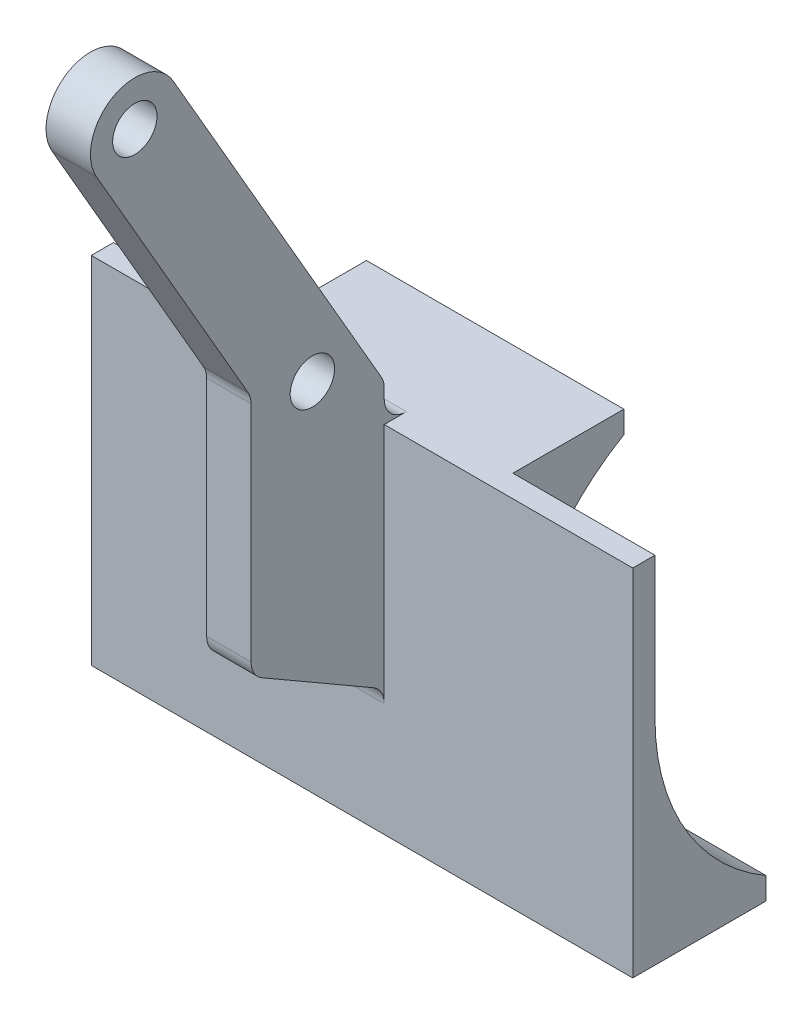
ISO-10303-21;
HEADER;
FILE_DESCRIPTION(('STEP AP214'),'2;1');
FILE_NAME('part.step','',(''),(''),'','','');
FILE_SCHEMA(('AUTOMOTIVE_DESIGN { 1 0 10303 214 1 1 1 1 }'));
ENDSEC;
DATA;
#1=APPLICATION_CONTEXT('core data for automotive mechanical design processes');
#2=APPLICATION_PROTOCOL_DEFINITION('international standard','automotive_design',2000,#1);
#3=PRODUCT_CONTEXT('',#1,'mechanical');
#4=PRODUCT('Part','Part','',(#3));
#5=PRODUCT_RELATED_PRODUCT_CATEGORY('part','',(#4));
#6=PRODUCT_DEFINITION_FORMATION('','',#4);
#7=PRODUCT_DEFINITION_CONTEXT('part definition',#1,'design');
#8=PRODUCT_DEFINITION('design','',#6,#7);
#9=PRODUCT_DEFINITION_SHAPE('','',#8);
#10=(LENGTH_UNIT() NAMED_UNIT(*) SI_UNIT(.MILLI.,.METRE.));
#11=(NAMED_UNIT(*) PLANE_ANGLE_UNIT() SI_UNIT($,.RADIAN.));
#12=(NAMED_UNIT(*) SI_UNIT($,.STERADIAN.) SOLID_ANGLE_UNIT());
#13=UNCERTAINTY_MEASURE_WITH_UNIT(LENGTH_MEASURE(1.E-05),#10,'distance_accuracy_value','');
#14=(GEOMETRIC_REPRESENTATION_CONTEXT(3) GLOBAL_UNCERTAINTY_ASSIGNED_CONTEXT((#13)) GLOBAL_UNIT_ASSIGNED_CONTEXT((#10,
#11,#12)) REPRESENTATION_CONTEXT('',''));
#15=CARTESIAN_POINT('',(0.,0.,0.));
#16=DIRECTION('',(0.,0.,1.));
#17=DIRECTION('',(1.,0.,0.));
#18=AXIS2_PLACEMENT_3D('',#15,#16,#17);
#19=CARTESIAN_POINT('',(76.2,-10.5426131403119,-69.85));
#20=DIRECTION('',(-1.,0.,0.));
#21=DIRECTION('',(0.,0.,1.));
#22=AXIS2_PLACEMENT_3D('',#19,#20,#21);
#23=CYLINDRICAL_SURFACE('',#22,63.5);
#24=CARTESIAN_POINT('',(-36.83,-10.5426131403119,-69.85));
#25=DIRECTION('',(-1.,0.,0.));
#26=DIRECTION('',(0.,0.,-1.));
#27=AXIS2_PLACEMENT_3D('',#24,#25,#26);
#28=CIRCLE('',#27,63.5);
#29=CARTESIAN_POINT('',(-36.83,-10.5426131403118,-6.35000000000001));
#30=VERTEX_POINT('',#29);
#31=CARTESIAN_POINT('',(-36.83,44.45,-38.1));
#32=VERTEX_POINT('',#31);
#33=EDGE_CURVE('E210',#30,#32,#28,.T.);
#34=ORIENTED_EDGE('',*,*,#33,.T.);
#35=DIRECTION('',(-1.,0.,0.));
#36=VECTOR('',#35,1.);
#37=CARTESIAN_POINT('',(76.2,44.45,-38.1));
#38=LINE('',#37,#36);
#39=CARTESIAN_POINT('',(36.83,44.45,-38.1));
#40=VERTEX_POINT('',#39);
#41=EDGE_CURVE('E234',#40,#32,#38,.T.);
#42=ORIENTED_EDGE('',*,*,#41,.F.);
#43=CARTESIAN_POINT('',(36.83,-10.5426131403119,-69.85));
#44=DIRECTION('',(-1.,0.,0.));
#45=DIRECTION('',(0.,0.,-1.));
#46=AXIS2_PLACEMENT_3D('',#43,#44,#45);
#47=CIRCLE('',#46,63.5);
#48=CARTESIAN_POINT('',(36.83,-10.5426131403118,-6.35000000000001));
#49=VERTEX_POINT('',#48);
#50=EDGE_CURVE('E232',#49,#40,#47,.T.);
#51=ORIENTED_EDGE('',*,*,#50,.F.);
#52=DIRECTION('',(-1.,0.,0.));
#53=VECTOR('',#52,1.);
#54=CARTESIAN_POINT('',(76.2,-10.5426131403118,-6.35000000000001));
#55=LINE('',#54,#53);
#56=EDGE_CURVE('E226',#49,#30,#55,.T.);
#57=ORIENTED_EDGE('',*,*,#56,.T.);
#58=EDGE_LOOP('',(#34,#42,#51,#57));
#59=FACE_BOUND('',#58,.T.);
#60=ADVANCED_FACE('F35',(#59),#23,.F.);
#61=CARTESIAN_POINT('',(76.2,50.8,-38.1));
#62=DIRECTION('',(0.,0.,1.));
#63=DIRECTION('',(1.,0.,0.));
#64=AXIS2_PLACEMENT_3D('',#61,#62,#63);
#65=PLANE('',#64);
#66=DIRECTION('',(0.,1.,0.));
#67=VECTOR('',#66,1.);
#68=CARTESIAN_POINT('',(-36.83,44.45,-38.1));
#69=LINE('',#68,#67);
#70=CARTESIAN_POINT('',(-36.83,50.8,-38.1));
#71=VERTEX_POINT('',#70);
#72=EDGE_CURVE('E216',#32,#71,#69,.T.);
#73=ORIENTED_EDGE('',*,*,#72,.T.);
#74=DIRECTION('',(-1.,0.,0.));
#75=VECTOR('',#74,1.);
#76=CARTESIAN_POINT('',(76.2,50.8,-38.1));
#77=LINE('',#76,#75);
#78=CARTESIAN_POINT('',(36.83,50.8,-38.1));
#79=VERTEX_POINT('',#78);
#80=EDGE_CURVE('E239',#79,#71,#77,.T.);
#81=ORIENTED_EDGE('',*,*,#80,.F.);
#82=DIRECTION('',(0.,1.,0.));
#83=VECTOR('',#82,1.);
#84=CARTESIAN_POINT('',(36.83,44.45,-38.1));
#85=LINE('',#84,#83);
#86=EDGE_CURVE('E424',#40,#79,#85,.T.);
#87=ORIENTED_EDGE('',*,*,#86,.F.);
#88=ORIENTED_EDGE('',*,*,#41,.T.);
#89=EDGE_LOOP('',(#73,#81,#87,#88));
#90=FACE_BOUND('',#89,.T.);
#91=ADVANCED_FACE('F423',(#90),#65,.F.);
#92=CARTESIAN_POINT('',(76.2,50.8,0.));
#93=DIRECTION('',(0.,-1.,0.));
#94=DIRECTION('',(0.,0.,-1.));
#95=AXIS2_PLACEMENT_3D('',#92,#93,#94);
#96=PLANE('',#95);
#97=DIRECTION('',(0.,0.,1.));
#98=VECTOR('',#97,1.);
#99=CARTESIAN_POINT('',(-36.83,50.8,-38.1));
#100=LINE('',#99,#98);
#101=CARTESIAN_POINT('',(-36.83,50.8,-6.35));
#102=VERTEX_POINT('',#101);
#103=EDGE_CURVE('E229',#71,#102,#100,.T.);
#104=ORIENTED_EDGE('',*,*,#103,.T.);
#105=DIRECTION('',(1.,0.,0.));
#106=VECTOR('',#105,1.);
#107=CARTESIAN_POINT('',(-77.47,50.8,-6.34999999999998));
#108=LINE('',#107,#106);
#109=CARTESIAN_POINT('',(-77.47,50.8,-6.34999999999998));
#110=VERTEX_POINT('',#109);
#111=EDGE_CURVE('E228',#110,#102,#108,.T.);
#112=ORIENTED_EDGE('',*,*,#111,.F.);
#113=DIRECTION('',(0.,0.,1.));
#114=VECTOR('',#113,1.);
#115=CARTESIAN_POINT('',(-77.47,50.8,0.));
#116=LINE('',#115,#114);
#117=CARTESIAN_POINT('',(-77.47,50.8,0.));
#118=VERTEX_POINT('',#117);
#119=EDGE_CURVE('E342',#110,#118,#116,.T.);
#120=ORIENTED_EDGE('',*,*,#119,.T.);
#121=DIRECTION('',(-1.,0.,0.));
#122=VECTOR('',#121,1.);
#123=CARTESIAN_POINT('',(76.2,50.8,0.));
#124=LINE('',#123,#122);
#125=CARTESIAN_POINT('',(-6.35,50.8,0.));
#126=VERTEX_POINT('',#125);
#127=EDGE_CURVE('E411',#126,#118,#124,.T.);
#128=ORIENTED_EDGE('',*,*,#127,.F.);
#129=DIRECTION('',(0.,0.,-1.));
#130=VECTOR('',#129,1.);
#131=CARTESIAN_POINT('',(-6.34999999999999,50.8,0.));
#132=LINE('',#131,#130);
#133=CARTESIAN_POINT('',(-6.35,50.8,-6.34999999999998));
#134=VERTEX_POINT('',#133);
#135=EDGE_CURVE('E50',#126,#134,#132,.T.);
#136=ORIENTED_EDGE('',*,*,#135,.T.);
#137=DIRECTION('',(-1.,0.,0.));
#138=VECTOR('',#137,1.);
#139=CARTESIAN_POINT('',(6.35,50.8,-6.34999999999998));
#140=LINE('',#139,#138);
#141=CARTESIAN_POINT('',(6.35,50.8,-6.34999999999998));
#142=VERTEX_POINT('',#141);
#143=EDGE_CURVE('E276',#134,#142,#140,.F.);
#144=ORIENTED_EDGE('',*,*,#143,.T.);
#145=DIRECTION('',(0.,0.,1.));
#146=VECTOR('',#145,1.);
#147=CARTESIAN_POINT('',(6.35,50.8,71.3587873496661));
#148=LINE('',#147,#146);
#149=CARTESIAN_POINT('',(6.35,50.8,0.));
#150=VERTEX_POINT('',#149);
#151=EDGE_CURVE('E274',#142,#150,#148,.T.);
#152=ORIENTED_EDGE('',*,*,#151,.T.);
#153=CARTESIAN_POINT('',(77.47,50.8,0.));
#154=VERTEX_POINT('',#153);
#155=EDGE_CURVE('E412',#154,#150,#124,.T.);
#156=ORIENTED_EDGE('',*,*,#155,.F.);
#157=DIRECTION('',(0.,0.,1.));
#158=VECTOR('',#157,1.);
#159=CARTESIAN_POINT('',(77.47,50.8,0.));
#160=LINE('',#159,#158);
#161=CARTESIAN_POINT('',(77.47,50.8,-6.34999999999998));
#162=VERTEX_POINT('',#161);
#163=EDGE_CURVE('E376',#162,#154,#160,.T.);
#164=ORIENTED_EDGE('',*,*,#163,.F.);
#165=DIRECTION('',(-1.,0.,0.));
#166=VECTOR('',#165,1.);
#167=CARTESIAN_POINT('',(77.47,50.8,-6.34999999999998));
#168=LINE('',#167,#166);
#169=CARTESIAN_POINT('',(36.83,50.8,-6.35));
#170=VERTEX_POINT('',#169);
#171=EDGE_CURVE('E391',#162,#170,#168,.T.);
#172=ORIENTED_EDGE('',*,*,#171,.T.);
#173=DIRECTION('',(0.,0.,1.));
#174=VECTOR('',#173,1.);
#175=CARTESIAN_POINT('',(36.83,50.8,-38.1));
#176=LINE('',#175,#174);
#177=EDGE_CURVE('E420',#79,#170,#176,.T.);
#178=ORIENTED_EDGE('',*,*,#177,.F.);
#179=ORIENTED_EDGE('',*,*,#80,.T.);
#180=EDGE_LOOP('',(#104,#112,#120,#128,#136,#144,#152,#156,#164,#172,#178,#179));
#181=FACE_BOUND('',#180,.T.);
#182=ADVANCED_FACE('F418',(#181),#96,.F.);
#183=CARTESIAN_POINT('',(76.2,50.8,0.));
#184=DIRECTION('',(0.,0.,-1.));
#185=DIRECTION('',(0.,1.,0.));
#186=AXIS2_PLACEMENT_3D('',#183,#184,#185);
#187=PLANE('',#186);
#188=DIRECTION('',(-1.,0.,0.));
#189=VECTOR('',#188,1.);
#190=CARTESIAN_POINT('',(-6.34999999999999,-18.3308710467705,0.));
#191=LINE('',#190,#189);
#192=CARTESIAN_POINT('',(6.35,-18.3308710467705,0.));
#193=VERTEX_POINT('',#192);
#194=CARTESIAN_POINT('',(-6.35,-18.3308710467705,0.));
#195=VERTEX_POINT('',#194);
#196=EDGE_CURVE('E245',#193,#195,#191,.T.);
#197=ORIENTED_EDGE('',*,*,#196,.T.);
#198=DIRECTION('',(0.,1.,0.));
#199=VECTOR('',#198,1.);
#200=CARTESIAN_POINT('',(-6.35,14.6646968374165,0.));
#201=LINE('',#200,#199);
#202=EDGE_CURVE('E456',#195,#126,#201,.T.);
#203=ORIENTED_EDGE('',*,*,#202,.T.);
#204=ORIENTED_EDGE('',*,*,#127,.T.);
#205=DIRECTION('',(0.,-1.,0.));
#206=VECTOR('',#205,1.);
#207=CARTESIAN_POINT('',(-77.47,50.8,0.));
#208=LINE('',#207,#206);
#209=CARTESIAN_POINT('',(-77.47,-50.8,0.));
#210=VERTEX_POINT('',#209);
#211=EDGE_CURVE('E357',#118,#210,#208,.T.);
#212=ORIENTED_EDGE('',*,*,#211,.T.);
#213=DIRECTION('',(-1.,0.,0.));
#214=VECTOR('',#213,1.);
#215=CARTESIAN_POINT('',(76.2,-50.8,0.));
#216=LINE('',#215,#214);
#217=CARTESIAN_POINT('',(77.47,-50.8,0.));
#218=VERTEX_POINT('',#217);
#219=EDGE_CURVE('E237',#218,#210,#216,.T.);
#220=ORIENTED_EDGE('',*,*,#219,.F.);
#221=DIRECTION('',(0.,-1.,0.));
#222=VECTOR('',#221,1.);
#223=CARTESIAN_POINT('',(77.47,50.8,0.));
#224=LINE('',#223,#222);
#225=EDGE_CURVE('E379',#154,#218,#224,.T.);
#226=ORIENTED_EDGE('',*,*,#225,.F.);
#227=ORIENTED_EDGE('',*,*,#155,.T.);
#228=DIRECTION('',(0.,1.,0.));
#229=VECTOR('',#228,1.);
#230=CARTESIAN_POINT('',(6.35,14.6646968374165,0.));
#231=LINE('',#230,#229);
#232=EDGE_CURVE('E446',#193,#150,#231,.T.);
#233=ORIENTED_EDGE('',*,*,#232,.F.);
#234=EDGE_LOOP('',(#197,#203,#204,#212,#220,#226,#227,#233));
#235=FACE_BOUND('',#234,.T.);
#236=ADVANCED_FACE('F483',(#235),#187,.F.);
#237=CARTESIAN_POINT('',(76.2,-50.8,-6.35000000000001));
#238=DIRECTION('',(0.,1.,0.));
#239=DIRECTION('',(0.,0.,1.));
#240=AXIS2_PLACEMENT_3D('',#237,#238,#239);
#241=PLANE('',#240);
#242=ORIENTED_EDGE('',*,*,#219,.T.);
#243=DIRECTION('',(0.,0.,-1.));
#244=VECTOR('',#243,1.);
#245=CARTESIAN_POINT('',(-77.47,-50.8,0.));
#246=LINE('',#245,#244);
#247=CARTESIAN_POINT('',(-77.47,-50.8,-38.1));
#248=VERTEX_POINT('',#247);
#249=EDGE_CURVE('E354',#210,#248,#246,.T.);
#250=ORIENTED_EDGE('',*,*,#249,.T.);
#251=DIRECTION('',(1.,0.,0.));
#252=VECTOR('',#251,1.);
#253=CARTESIAN_POINT('',(-77.47,-50.8,-38.1));
#254=LINE('',#253,#252);
#255=CARTESIAN_POINT('',(-39.37,-50.8,-38.1));
#256=VERTEX_POINT('',#255);
#257=EDGE_CURVE('E360',#248,#256,#254,.T.);
#258=ORIENTED_EDGE('',*,*,#257,.T.);
#259=DIRECTION('',(0.,0.,-1.));
#260=VECTOR('',#259,1.);
#261=CARTESIAN_POINT('',(-39.37,-50.8,0.));
#262=LINE('',#261,#260);
#263=CARTESIAN_POINT('',(-39.37,-50.8,-6.35000000000001));
#264=VERTEX_POINT('',#263);
#265=EDGE_CURVE('E346',#264,#256,#262,.T.);
#266=ORIENTED_EDGE('',*,*,#265,.F.);
#267=DIRECTION('',(-1.,0.,0.));
#268=VECTOR('',#267,1.);
#269=CARTESIAN_POINT('',(76.2,-50.8,-6.35000000000001));
#270=LINE('',#269,#268);
#271=CARTESIAN_POINT('',(39.37,-50.8,-6.35000000000001));
#272=VERTEX_POINT('',#271);
#273=EDGE_CURVE('E233',#272,#264,#270,.T.);
#274=ORIENTED_EDGE('',*,*,#273,.F.);
#275=DIRECTION('',(0.,0.,-1.));
#276=VECTOR('',#275,1.);
#277=CARTESIAN_POINT('',(39.37,-50.8,0.));
#278=LINE('',#277,#276);
#279=CARTESIAN_POINT('',(39.37,-50.8,-38.1));
#280=VERTEX_POINT('',#279);
#281=EDGE_CURVE('E375',#272,#280,#278,.T.);
#282=ORIENTED_EDGE('',*,*,#281,.T.);
#283=DIRECTION('',(-1.,0.,0.));
#284=VECTOR('',#283,1.);
#285=CARTESIAN_POINT('',(77.47,-50.8,-38.1));
#286=LINE('',#285,#284);
#287=CARTESIAN_POINT('',(77.47,-50.8,-38.1));
#288=VERTEX_POINT('',#287);
#289=EDGE_CURVE('E404',#288,#280,#286,.T.);
#290=ORIENTED_EDGE('',*,*,#289,.F.);
#291=DIRECTION('',(0.,0.,-1.));
#292=VECTOR('',#291,1.);
#293=CARTESIAN_POINT('',(77.47,-50.8,0.));
#294=LINE('',#293,#292);
#295=EDGE_CURVE('E383',#218,#288,#294,.T.);
#296=ORIENTED_EDGE('',*,*,#295,.F.);
#297=EDGE_LOOP('',(#242,#250,#258,#266,#274,#282,#290,#296));
#298=FACE_BOUND('',#297,.T.);
#299=ADVANCED_FACE('F516',(#298),#241,.F.);
#300=CARTESIAN_POINT('',(76.2,-10.5426131403119,-6.35000000000001));
#301=DIRECTION('',(0.,0.,1.));
#302=DIRECTION('',(0.,-1.,0.));
#303=AXIS2_PLACEMENT_3D('',#300,#301,#302);
#304=PLANE('',#303);
#305=DIRECTION('',(0.,1.,0.));
#306=VECTOR('',#305,1.);
#307=CARTESIAN_POINT('',(-39.37,-50.8,-6.35000000000001));
#308=LINE('',#307,#306);
#309=CARTESIAN_POINT('',(-39.37,10.5426131403119,-6.35000000000002));
#310=VERTEX_POINT('',#309);
#311=EDGE_CURVE('E407',#264,#310,#308,.T.);
#312=ORIENTED_EDGE('',*,*,#311,.T.);
#313=DIRECTION('',(1.,0.,0.));
#314=VECTOR('',#313,1.);
#315=CARTESIAN_POINT('',(-77.47,10.5426131403119,-6.34999999999999));
#316=LINE('',#315,#314);
#317=CARTESIAN_POINT('',(-77.47,10.5426131403119,-6.34999999999999));
#318=VERTEX_POINT('',#317);
#319=EDGE_CURVE('E371',#318,#310,#316,.T.);
#320=ORIENTED_EDGE('',*,*,#319,.F.);
#321=DIRECTION('',(0.,1.,0.));
#322=VECTOR('',#321,1.);
#323=CARTESIAN_POINT('',(-77.47,50.8,-6.34999999999998));
#324=LINE('',#323,#322);
#325=EDGE_CURVE('E345',#318,#110,#324,.T.);
#326=ORIENTED_EDGE('',*,*,#325,.T.);
#327=ORIENTED_EDGE('',*,*,#111,.T.);
#328=DIRECTION('',(0.,-1.,0.));
#329=VECTOR('',#328,1.);
#330=CARTESIAN_POINT('',(-36.83,50.8,-6.35));
#331=LINE('',#330,#329);
#332=EDGE_CURVE('E213',#102,#30,#331,.T.);
#333=ORIENTED_EDGE('',*,*,#332,.T.);
#334=ORIENTED_EDGE('',*,*,#56,.F.);
#335=DIRECTION('',(0.,-1.,0.));
#336=VECTOR('',#335,1.);
#337=CARTESIAN_POINT('',(36.83,50.8,-6.35));
#338=LINE('',#337,#336);
#339=EDGE_CURVE('E431',#170,#49,#338,.T.);
#340=ORIENTED_EDGE('',*,*,#339,.F.);
#341=ORIENTED_EDGE('',*,*,#171,.F.);
#342=DIRECTION('',(0.,1.,0.));
#343=VECTOR('',#342,1.);
#344=CARTESIAN_POINT('',(77.47,50.8,-6.34999999999998));
#345=LINE('',#344,#343);
#346=CARTESIAN_POINT('',(77.47,10.5426131403119,-6.34999999999999));
#347=VERTEX_POINT('',#346);
#348=EDGE_CURVE('E389',#347,#162,#345,.T.);
#349=ORIENTED_EDGE('',*,*,#348,.F.);
#350=DIRECTION('',(-1.,0.,0.));
#351=VECTOR('',#350,1.);
#352=CARTESIAN_POINT('',(77.47,10.5426131403119,-6.34999999999999));
#353=LINE('',#352,#351);
#354=CARTESIAN_POINT('',(39.37,10.5426131403119,-6.35000000000001));
#355=VERTEX_POINT('',#354);
#356=EDGE_CURVE('E398',#347,#355,#353,.T.);
#357=ORIENTED_EDGE('',*,*,#356,.T.);
#358=DIRECTION('',(0.,1.,0.));
#359=VECTOR('',#358,1.);
#360=CARTESIAN_POINT('',(39.37,-50.8,-6.35000000000001));
#361=LINE('',#360,#359);
#362=EDGE_CURVE('E409',#272,#355,#361,.T.);
#363=ORIENTED_EDGE('',*,*,#362,.F.);
#364=ORIENTED_EDGE('',*,*,#273,.T.);
#365=EDGE_LOOP('',(#312,#320,#326,#327,#333,#334,#340,#341,#349,#357,#363,#364));
#366=FACE_BOUND('',#365,.T.);
#367=ADVANCED_FACE('F224',(#366),#304,.F.);
#368=CARTESIAN_POINT('',(39.37,10.5426131403119,-69.85));
#369=DIRECTION('',(1.,0.,0.));
#370=DIRECTION('',(0.,0.,-1.));
#371=AXIS2_PLACEMENT_3D('',#368,#369,#370);
#372=PLANE('',#371);
#373=ORIENTED_EDGE('',*,*,#281,.F.);
#374=ORIENTED_EDGE('',*,*,#362,.T.);
#375=CARTESIAN_POINT('',(39.37,10.5426131403119,-69.85));
#376=DIRECTION('',(-1.,0.,0.));
#377=DIRECTION('',(0.,0.,-1.));
#378=AXIS2_PLACEMENT_3D('',#375,#376,#377);
#379=CIRCLE('',#378,63.5);
#380=CARTESIAN_POINT('',(39.37,-44.45,-38.1));
#381=VERTEX_POINT('',#380);
#382=EDGE_CURVE('E244',#381,#355,#379,.T.);
#383=ORIENTED_EDGE('',*,*,#382,.F.);
#384=DIRECTION('',(0.,1.,0.));
#385=VECTOR('',#384,1.);
#386=CARTESIAN_POINT('',(39.37,-50.8,-38.1));
#387=LINE('',#386,#385);
#388=EDGE_CURVE('E380',#280,#381,#387,.T.);
#389=ORIENTED_EDGE('',*,*,#388,.F.);
#390=EDGE_LOOP('',(#373,#374,#383,#389));
#391=FACE_BOUND('',#390,.T.);
#392=ADVANCED_FACE('F515',(#391),#372,.F.);
#393=CARTESIAN_POINT('',(77.47,-50.8,-38.1));
#394=DIRECTION('',(0.,0.,1.));
#395=DIRECTION('',(1.,0.,0.));
#396=AXIS2_PLACEMENT_3D('',#393,#394,#395);
#397=PLANE('',#396);
#398=ORIENTED_EDGE('',*,*,#388,.T.);
#399=DIRECTION('',(-1.,0.,0.));
#400=VECTOR('',#399,1.);
#401=CARTESIAN_POINT('',(77.47,-44.45,-38.1));
#402=LINE('',#401,#400);
#403=CARTESIAN_POINT('',(77.47,-44.45,-38.1));
#404=VERTEX_POINT('',#403);
#405=EDGE_CURVE('E401',#404,#381,#402,.T.);
#406=ORIENTED_EDGE('',*,*,#405,.F.);
#407=DIRECTION('',(0.,1.,0.));
#408=VECTOR('',#407,1.);
#409=CARTESIAN_POINT('',(77.47,-50.8,-38.1));
#410=LINE('',#409,#408);
#411=EDGE_CURVE('E385',#288,#404,#410,.T.);
#412=ORIENTED_EDGE('',*,*,#411,.F.);
#413=ORIENTED_EDGE('',*,*,#289,.T.);
#414=EDGE_LOOP('',(#398,#406,#412,#413));
#415=FACE_BOUND('',#414,.T.);
#416=ADVANCED_FACE('F527',(#415),#397,.F.);
#417=CARTESIAN_POINT('',(77.47,10.5426131403119,-69.85));
#418=DIRECTION('',(-1.,0.,0.));
#419=DIRECTION('',(0.,0.,1.));
#420=AXIS2_PLACEMENT_3D('',#417,#418,#419);
#421=CYLINDRICAL_SURFACE('',#420,63.5);
#422=ORIENTED_EDGE('',*,*,#405,.T.);
#423=ORIENTED_EDGE('',*,*,#382,.T.);
#424=ORIENTED_EDGE('',*,*,#356,.F.);
#425=CARTESIAN_POINT('',(77.47,10.5426131403119,-69.85));
#426=DIRECTION('',(-1.,0.,0.));
#427=DIRECTION('',(0.,0.,-1.));
#428=AXIS2_PLACEMENT_3D('',#425,#426,#427);
#429=CIRCLE('',#428,63.5);
#430=EDGE_CURVE('E387',#404,#347,#429,.T.);
#431=ORIENTED_EDGE('',*,*,#430,.F.);
#432=EDGE_LOOP('',(#422,#423,#424,#431));
#433=FACE_BOUND('',#432,.T.);
#434=ADVANCED_FACE('F530',(#433),#421,.F.);
#435=CARTESIAN_POINT('',(77.47,10.5426131403119,-69.85));
#436=DIRECTION('',(1.,0.,0.));
#437=DIRECTION('',(0.,0.,-1.));
#438=AXIS2_PLACEMENT_3D('',#435,#436,#437);
#439=PLANE('',#438);
#440=ORIENTED_EDGE('',*,*,#163,.T.);
#441=ORIENTED_EDGE('',*,*,#225,.T.);
#442=ORIENTED_EDGE('',*,*,#295,.T.);
#443=ORIENTED_EDGE('',*,*,#411,.T.);
#444=ORIENTED_EDGE('',*,*,#430,.T.);
#445=ORIENTED_EDGE('',*,*,#348,.T.);
#446=EDGE_LOOP('',(#440,#441,#442,#443,#444,#445));
#447=FACE_BOUND('',#446,.T.);
#448=ADVANCED_FACE('F534',(#447),#439,.T.);
#449=CARTESIAN_POINT('',(-77.47,10.5426131403119,-69.85));
#450=DIRECTION('',(1.,0.,0.));
#451=DIRECTION('',(0.,0.,-1.));
#452=AXIS2_PLACEMENT_3D('',#449,#450,#451);
#453=CYLINDRICAL_SURFACE('',#452,63.5);
#454=CARTESIAN_POINT('',(-39.37,10.5426131403119,-69.85));
#455=DIRECTION('',(-1.,0.,0.));
#456=DIRECTION('',(0.,0.,-1.));
#457=AXIS2_PLACEMENT_3D('',#454,#455,#456);
#458=CIRCLE('',#457,63.5);
#459=CARTESIAN_POINT('',(-39.37,-44.45,-38.1));
#460=VERTEX_POINT('',#459);
#461=EDGE_CURVE('E249',#460,#310,#458,.T.);
#462=ORIENTED_EDGE('',*,*,#461,.F.);
#463=DIRECTION('',(1.,0.,0.));
#464=VECTOR('',#463,1.);
#465=CARTESIAN_POINT('',(-77.47,-44.45,-38.1));
#466=LINE('',#465,#464);
#467=CARTESIAN_POINT('',(-77.47,-44.45,-38.1));
#468=VERTEX_POINT('',#467);
#469=EDGE_CURVE('E368',#468,#460,#466,.T.);
#470=ORIENTED_EDGE('',*,*,#469,.F.);
#471=CARTESIAN_POINT('',(-77.47,10.5426131403119,-69.85));
#472=DIRECTION('',(-1.,0.,0.));
#473=DIRECTION('',(0.,0.,-1.));
#474=AXIS2_PLACEMENT_3D('',#471,#472,#473);
#475=CIRCLE('',#474,63.5);
#476=EDGE_CURVE('E348',#468,#318,#475,.T.);
#477=ORIENTED_EDGE('',*,*,#476,.T.);
#478=ORIENTED_EDGE('',*,*,#319,.T.);
#479=EDGE_LOOP('',(#462,#470,#477,#478));
#480=FACE_BOUND('',#479,.T.);
#481=ADVANCED_FACE('F541',(#480),#453,.F.);
#482=CARTESIAN_POINT('',(-77.47,-50.8,-38.1));
#483=DIRECTION('',(0.,0.,-1.));
#484=DIRECTION('',(-1.,0.,0.));
#485=AXIS2_PLACEMENT_3D('',#482,#483,#484);
#486=PLANE('',#485);
#487=DIRECTION('',(0.,1.,0.));
#488=VECTOR('',#487,1.);
#489=CARTESIAN_POINT('',(-39.37,-50.8,-38.1));
#490=LINE('',#489,#488);
#491=EDGE_CURVE('E341',#256,#460,#490,.T.);
#492=ORIENTED_EDGE('',*,*,#491,.F.);
#493=ORIENTED_EDGE('',*,*,#257,.F.);
#494=DIRECTION('',(0.,1.,0.));
#495=VECTOR('',#494,1.);
#496=CARTESIAN_POINT('',(-77.47,-50.8,-38.1));
#497=LINE('',#496,#495);
#498=EDGE_CURVE('E351',#248,#468,#497,.T.);
#499=ORIENTED_EDGE('',*,*,#498,.T.);
#500=ORIENTED_EDGE('',*,*,#469,.T.);
#501=EDGE_LOOP('',(#492,#493,#499,#500));
#502=FACE_BOUND('',#501,.T.);
#503=ADVANCED_FACE('F545',(#502),#486,.T.);
#504=CARTESIAN_POINT('',(-77.47,10.5426131403119,-69.85));
#505=DIRECTION('',(-1.,0.,0.));
#506=DIRECTION('',(0.,0.,-1.));
#507=AXIS2_PLACEMENT_3D('',#504,#505,#506);
#508=PLANE('',#507);
#509=ORIENTED_EDGE('',*,*,#119,.F.);
#510=ORIENTED_EDGE('',*,*,#325,.F.);
#511=ORIENTED_EDGE('',*,*,#476,.F.);
#512=ORIENTED_EDGE('',*,*,#498,.F.);
#513=ORIENTED_EDGE('',*,*,#249,.F.);
#514=ORIENTED_EDGE('',*,*,#211,.F.);
#515=EDGE_LOOP('',(#509,#510,#511,#512,#513,#514));
#516=FACE_BOUND('',#515,.T.);
#517=ADVANCED_FACE('F549',(#516),#508,.T.);
#518=CARTESIAN_POINT('',(-39.37,10.5426131403119,-69.85));
#519=DIRECTION('',(-1.,0.,0.));
#520=DIRECTION('',(0.,0.,-1.));
#521=AXIS2_PLACEMENT_3D('',#518,#519,#520);
#522=PLANE('',#521);
#523=ORIENTED_EDGE('',*,*,#491,.T.);
#524=ORIENTED_EDGE('',*,*,#461,.T.);
#525=ORIENTED_EDGE('',*,*,#311,.F.);
#526=ORIENTED_EDGE('',*,*,#265,.T.);
#527=EDGE_LOOP('',(#523,#524,#525,#526));
#528=FACE_BOUND('',#527,.T.);
#529=ADVANCED_FACE('F551',(#528),#522,.F.);
#530=CARTESIAN_POINT('',(6.35,14.6646968374165,0.));
#531=DIRECTION('',(0.,0.,1.));
#532=DIRECTION('',(1.,0.,0.));
#533=AXIS2_PLACEMENT_3D('',#530,#531,#532);
#534=PLANE('',#533);
#535=CARTESIAN_POINT('',(6.35,57.15,0.));
#536=VERTEX_POINT('',#535);
#537=CARTESIAN_POINT('',(6.35,59.8338257906458,0.));
#538=VERTEX_POINT('',#537);
#539=EDGE_CURVE('E336',#536,#538,#231,.T.);
#540=ORIENTED_EDGE('',*,*,#539,.F.);
#541=DIRECTION('',(-1.,0.,0.));
#542=VECTOR('',#541,1.);
#543=CARTESIAN_POINT('',(-6.35,57.15,0.));
#544=LINE('',#543,#542);
#545=CARTESIAN_POINT('',(-6.35,57.15,0.));
#546=VERTEX_POINT('',#545);
#547=EDGE_CURVE('E271',#536,#546,#544,.T.);
#548=ORIENTED_EDGE('',*,*,#547,.T.);
#549=CARTESIAN_POINT('',(-6.35,59.8338257906458,0.));
#550=VERTEX_POINT('',#549);
#551=EDGE_CURVE('E443',#546,#550,#201,.T.);
#552=ORIENTED_EDGE('',*,*,#551,.T.);
#553=DIRECTION('',(-1.,0.,0.));
#554=VECTOR('',#553,1.);
#555=CARTESIAN_POINT('',(6.35,59.8338257906458,0.));
#556=LINE('',#555,#554);
#557=EDGE_CURVE('E269',#550,#538,#556,.F.);
#558=ORIENTED_EDGE('',*,*,#557,.T.);
#559=EDGE_LOOP('',(#540,#548,#552,#558));
#560=FACE_BOUND('',#559,.T.);
#561=ADVANCED_FACE('F474',(#560),#534,.F.);
#562=CARTESIAN_POINT('',(6.35,159.732348418708,71.3587873496661));
#563=DIRECTION('',(-1.,0.,0.));
#564=DIRECTION('',(0.,0.,1.));
#565=AXIS2_PLACEMENT_3D('',#562,#563,#564);
#566=PLANE('',#565);
#567=DIRECTION('',(0.,-1.,0.));
#568=VECTOR('',#567,1.);
#569=CARTESIAN_POINT('',(6.35,76.7264389309577,38.1));
#570=LINE('',#569,#568);
#571=CARTESIAN_POINT('',(6.35,75.02496155902,38.1));
#572=VERTEX_POINT('',#571);
#573=CARTESIAN_POINT('',(6.35,10.9985226280623,38.1));
#574=VERTEX_POINT('',#573);
#575=EDGE_CURVE('E298',#572,#574,#570,.T.);
#576=ORIENTED_EDGE('',*,*,#575,.T.);
#577=CARTESIAN_POINT('',(6.35,10.9985226280624,31.75));
#578=DIRECTION('',(-1.,0.,0.));
#579=DIRECTION('',(0.,0.,1.));
#580=AXIS2_PLACEMENT_3D('',#577,#578,#579);
#581=CIRCLE('',#580,6.35);
#582=CARTESIAN_POINT('',(6.35,5.49926131403116,34.925));
#583=VERTEX_POINT('',#582);
#584=EDGE_CURVE('E265',#574,#583,#581,.F.);
#585=ORIENTED_EDGE('',*,*,#584,.T.);
#586=DIRECTION('',(0.,-0.499999999999998,-0.86602540378444));
#587=VECTOR('',#586,1.);
#588=CARTESIAN_POINT('',(6.35,7.33234841870822,38.1));
#589=LINE('',#588,#587);
#590=CARTESIAN_POINT('',(6.35,-12.8316097327393,3.17500000000003));
#591=VERTEX_POINT('',#590);
#592=EDGE_CURVE('E310',#583,#591,#589,.T.);
#593=ORIENTED_EDGE('',*,*,#592,.T.);
#594=CARTESIAN_POINT('',(6.34999999999999,-18.3308710467705,6.35));
#595=DIRECTION('',(-1.,0.,0.));
#596=DIRECTION('',(0.,0.,1.));
#597=AXIS2_PLACEMENT_3D('',#594,#595,#596);
#598=CIRCLE('',#597,6.35);
#599=EDGE_CURVE('E285',#591,#193,#598,.T.);
#600=ORIENTED_EDGE('',*,*,#599,.T.);
#601=ORIENTED_EDGE('',*,*,#232,.T.);
#602=ORIENTED_EDGE('',*,*,#151,.F.);
#603=CARTESIAN_POINT('',(6.35,57.15,-6.34999999999998));
#604=DIRECTION('',(-1.,0.,0.));
#605=DIRECTION('',(0.,0.,1.));
#606=AXIS2_PLACEMENT_3D('',#603,#604,#605);
#607=CIRCLE('',#606,6.35);
#608=EDGE_CURVE('E11',#142,#536,#607,.T.);
#609=ORIENTED_EDGE('',*,*,#608,.T.);
#610=ORIENTED_EDGE('',*,*,#539,.T.);
#611=CARTESIAN_POINT('',(6.35,59.8338257906458,6.35000000000002));
#612=DIRECTION('',(-1.,0.,0.));
#613=DIRECTION('',(0.,0.,1.));
#614=AXIS2_PLACEMENT_3D('',#611,#612,#613);
#615=CIRCLE('',#614,6.35);
#616=CARTESIAN_POINT('',(6.35,63.0088257906458,0.850738685968831));
#617=VERTEX_POINT('',#616);
#618=EDGE_CURVE('E263',#538,#617,#615,.F.);
#619=ORIENTED_EDGE('',*,*,#618,.T.);
#620=DIRECTION('',(0.,0.866025403784439,0.5));
#621=VECTOR('',#620,1.);
#622=CARTESIAN_POINT('',(6.35,61.5353031625835,0.));
#623=LINE('',#622,#621);
#624=CARTESIAN_POINT('',(6.35,166.082348418708,60.3602647216037));
#625=VERTEX_POINT('',#624);
#626=EDGE_CURVE('E449',#617,#625,#623,.T.);
#627=ORIENTED_EDGE('',*,*,#626,.T.);
#628=CARTESIAN_POINT('',(6.35,159.732348418708,71.3587873496661));
#629=DIRECTION('',(1.,0.,0.));
#630=DIRECTION('',(0.,0.,1.));
#631=AXIS2_PLACEMENT_3D('',#628,#629,#630);
#632=CIRCLE('',#631,12.7000000000001);
#633=CARTESIAN_POINT('',(6.35,153.382348418708,82.3573099777285));
#634=VERTEX_POINT('',#633);
#635=EDGE_CURVE('E451',#625,#634,#632,.T.);
#636=ORIENTED_EDGE('',*,*,#635,.T.);
#637=DIRECTION('',(0.,-0.866025403784438,-0.500000000000001));
#638=VECTOR('',#637,1.);
#639=CARTESIAN_POINT('',(6.35,153.382348418708,82.3573099777285));
#640=LINE('',#639,#638);
#641=CARTESIAN_POINT('',(6.35,78.19996155902,38.9507386859688));
#642=VERTEX_POINT('',#641);
#643=EDGE_CURVE('E301',#634,#642,#640,.T.);
#644=ORIENTED_EDGE('',*,*,#643,.T.);
#645=CARTESIAN_POINT('',(6.35,75.02496155902,44.45));
#646=DIRECTION('',(-1.,0.,0.));
#647=DIRECTION('',(0.,0.,1.));
#648=AXIS2_PLACEMENT_3D('',#645,#646,#647);
#649=CIRCLE('',#648,6.35);
#650=EDGE_CURVE('E290',#642,#572,#649,.T.);
#651=ORIENTED_EDGE('',*,*,#650,.T.);
#652=EDGE_LOOP('',(#576,#585,#593,#600,#601,#602,#609,#610,#619,#627,#636,#644,#651));
#653=FACE_BOUND('',#652,.T.);
#654=CARTESIAN_POINT('',(6.35,159.732348418708,71.3587873496661));
#655=DIRECTION('',(1.,0.,0.));
#656=DIRECTION('',(0.,0.,-1.));
#657=AXIS2_PLACEMENT_3D('',#654,#655,#656);
#658=CIRCLE('',#657,6.34999999999999);
#659=CARTESIAN_POINT('',(6.35,159.732348418708,65.0087873496661));
#660=VERTEX_POINT('',#659);
#661=EDGE_CURVE('E440',#660,#660,#658,.T.);
#662=ORIENTED_EDGE('',*,*,#661,.F.);
#663=EDGE_LOOP('',(#662));
#664=FACE_BOUND('',#663,.T.);
#665=CARTESIAN_POINT('',(6.35,71.7441673942093,20.5587873496661));
#666=DIRECTION('',(1.,0.,0.));
#667=DIRECTION('',(0.,0.,-1.));
#668=AXIS2_PLACEMENT_3D('',#665,#666,#667);
#669=CIRCLE('',#668,6.35);
#670=CARTESIAN_POINT('',(6.35,71.7441673942093,14.2087873496661));
#671=VERTEX_POINT('',#670);
#672=EDGE_CURVE('E434',#671,#671,#669,.T.);
#673=ORIENTED_EDGE('',*,*,#672,.F.);
#674=EDGE_LOOP('',(#673));
#675=FACE_BOUND('',#674,.T.);
#676=ADVANCED_FACE('F296',(#653,#664,#675),#566,.F.);
#677=CARTESIAN_POINT('',(-6.35,159.732348418708,71.3587873496661));
#678=DIRECTION('',(-1.,0.,0.));
#679=DIRECTION('',(0.,0.,1.));
#680=AXIS2_PLACEMENT_3D('',#677,#678,#679);
#681=PLANE('',#680);
#682=CARTESIAN_POINT('',(-6.35,159.732348418708,71.3587873496661));
#683=DIRECTION('',(1.,0.,0.));
#684=DIRECTION('',(0.,0.,-1.));
#685=AXIS2_PLACEMENT_3D('',#682,#683,#684);
#686=CIRCLE('',#685,6.34999999999999);
#687=CARTESIAN_POINT('',(-6.35,159.732348418708,65.0087873496661));
#688=VERTEX_POINT('',#687);
#689=EDGE_CURVE('E437',#688,#688,#686,.T.);
#690=ORIENTED_EDGE('',*,*,#689,.T.);
#691=EDGE_LOOP('',(#690));
#692=FACE_BOUND('',#691,.T.);
#693=DIRECTION('',(0.,-0.499999999999998,-0.86602540378444));
#694=VECTOR('',#693,1.);
#695=CARTESIAN_POINT('',(-6.35,7.33234841870822,38.1));
#696=LINE('',#695,#694);
#697=CARTESIAN_POINT('',(-6.35,5.49926131403116,34.925));
#698=VERTEX_POINT('',#697);
#699=CARTESIAN_POINT('',(-6.35,-12.8316097327393,3.17500000000003));
#700=VERTEX_POINT('',#699);
#701=EDGE_CURVE('E328',#698,#700,#696,.T.);
#702=ORIENTED_EDGE('',*,*,#701,.F.);
#703=CARTESIAN_POINT('',(-6.35,10.9985226280624,31.75));
#704=DIRECTION('',(-1.,0.,0.));
#705=DIRECTION('',(0.,0.,1.));
#706=AXIS2_PLACEMENT_3D('',#703,#704,#705);
#707=CIRCLE('',#706,6.35);
#708=CARTESIAN_POINT('',(-6.35,10.9985226280623,38.1));
#709=VERTEX_POINT('',#708);
#710=EDGE_CURVE('E256',#698,#709,#707,.T.);
#711=ORIENTED_EDGE('',*,*,#710,.T.);
#712=DIRECTION('',(0.,-1.,0.));
#713=VECTOR('',#712,1.);
#714=CARTESIAN_POINT('',(-6.35,76.7264389309577,38.1));
#715=LINE('',#714,#713);
#716=CARTESIAN_POINT('',(-6.35,75.02496155902,38.1));
#717=VERTEX_POINT('',#716);
#718=EDGE_CURVE('E320',#717,#709,#715,.T.);
#719=ORIENTED_EDGE('',*,*,#718,.F.);
#720=CARTESIAN_POINT('',(-6.35,75.02496155902,44.45));
#721=DIRECTION('',(-1.,0.,0.));
#722=DIRECTION('',(0.,0.,1.));
#723=AXIS2_PLACEMENT_3D('',#720,#721,#722);
#724=CIRCLE('',#723,6.35);
#725=CARTESIAN_POINT('',(-6.35,78.19996155902,38.9507386859688));
#726=VERTEX_POINT('',#725);
#727=EDGE_CURVE('E288',#717,#726,#724,.F.);
#728=ORIENTED_EDGE('',*,*,#727,.T.);
#729=DIRECTION('',(0.,-0.866025403784438,-0.500000000000001));
#730=VECTOR('',#729,1.);
#731=CARTESIAN_POINT('',(-6.35,153.382348418708,82.3573099777285));
#732=LINE('',#731,#730);
#733=CARTESIAN_POINT('',(-6.35,153.382348418708,82.3573099777285));
#734=VERTEX_POINT('',#733);
#735=EDGE_CURVE('E319',#734,#726,#732,.T.);
#736=ORIENTED_EDGE('',*,*,#735,.F.);
#737=CARTESIAN_POINT('',(-6.35,159.732348418708,71.3587873496661));
#738=DIRECTION('',(1.,0.,0.));
#739=DIRECTION('',(0.,0.,1.));
#740=AXIS2_PLACEMENT_3D('',#737,#738,#739);
#741=CIRCLE('',#740,12.7000000000001);
#742=CARTESIAN_POINT('',(-6.35,166.082348418708,60.3602647216037));
#743=VERTEX_POINT('',#742);
#744=EDGE_CURVE('E326',#743,#734,#741,.T.);
#745=ORIENTED_EDGE('',*,*,#744,.F.);
#746=DIRECTION('',(0.,0.866025403784439,0.5));
#747=VECTOR('',#746,1.);
#748=CARTESIAN_POINT('',(-6.35,61.5353031625835,0.));
#749=LINE('',#748,#747);
#750=CARTESIAN_POINT('',(-6.35,63.0088257906458,0.850738685968831));
#751=VERTEX_POINT('',#750);
#752=EDGE_CURVE('E330',#751,#743,#749,.T.);
#753=ORIENTED_EDGE('',*,*,#752,.F.);
#754=CARTESIAN_POINT('',(-6.35,59.8338257906458,6.35000000000002));
#755=DIRECTION('',(-1.,0.,0.));
#756=DIRECTION('',(0.,0.,1.));
#757=AXIS2_PLACEMENT_3D('',#754,#755,#756);
#758=CIRCLE('',#757,6.35);
#759=EDGE_CURVE('E254',#751,#550,#758,.T.);
#760=ORIENTED_EDGE('',*,*,#759,.T.);
#761=ORIENTED_EDGE('',*,*,#551,.F.);
#762=CARTESIAN_POINT('',(-6.35,57.15,-6.34999999999998));
#763=DIRECTION('',(-1.,0.,0.));
#764=DIRECTION('',(0.,0.,1.));
#765=AXIS2_PLACEMENT_3D('',#762,#763,#764);
#766=CIRCLE('',#765,6.35);
#767=EDGE_CURVE('E43',#546,#134,#766,.F.);
#768=ORIENTED_EDGE('',*,*,#767,.T.);
#769=ORIENTED_EDGE('',*,*,#135,.F.);
#770=ORIENTED_EDGE('',*,*,#202,.F.);
#771=CARTESIAN_POINT('',(-6.34999999999999,-18.3308710467705,6.35));
#772=DIRECTION('',(-1.,0.,0.));
#773=DIRECTION('',(0.,0.,1.));
#774=AXIS2_PLACEMENT_3D('',#771,#772,#773);
#775=CIRCLE('',#774,6.35);
#776=EDGE_CURVE('E283',#195,#700,#775,.F.);
#777=ORIENTED_EDGE('',*,*,#776,.T.);
#778=EDGE_LOOP('',(#702,#711,#719,#728,#736,#745,#753,#760,#761,#768,#769,#770,#777));
#779=FACE_BOUND('',#778,.T.);
#780=CARTESIAN_POINT('',(-6.35,71.7441673942093,20.5587873496661));
#781=DIRECTION('',(1.,0.,0.));
#782=DIRECTION('',(0.,0.,-1.));
#783=AXIS2_PLACEMENT_3D('',#780,#781,#782);
#784=CIRCLE('',#783,6.35);
#785=CARTESIAN_POINT('',(-6.35,71.7441673942093,14.2087873496661));
#786=VERTEX_POINT('',#785);
#787=EDGE_CURVE('E433',#786,#786,#784,.T.);
#788=ORIENTED_EDGE('',*,*,#787,.T.);
#789=EDGE_LOOP('',(#788));
#790=FACE_BOUND('',#789,.T.);
#791=ADVANCED_FACE('F316',(#692,#779,#790),#681,.T.);
#792=CARTESIAN_POINT('',(6.35,61.5353031625835,0.));
#793=DIRECTION('',(0.,-0.5,0.866025403784439));
#794=DIRECTION('',(0.,-0.866025403784439,-0.5));
#795=AXIS2_PLACEMENT_3D('',#792,#793,#794);
#796=PLANE('',#795);
#797=ORIENTED_EDGE('',*,*,#626,.F.);
#798=DIRECTION('',(-1.,0.,0.));
#799=VECTOR('',#798,1.);
#800=CARTESIAN_POINT('',(6.35,63.0088257906458,0.850738685968831));
#801=LINE('',#800,#799);
#802=EDGE_CURVE('E280',#617,#751,#801,.T.);
#803=ORIENTED_EDGE('',*,*,#802,.T.);
#804=ORIENTED_EDGE('',*,*,#752,.T.);
#805=DIRECTION('',(-1.,0.,0.));
#806=VECTOR('',#805,1.);
#807=CARTESIAN_POINT('',(6.35,166.082348418708,60.3602647216037));
#808=LINE('',#807,#806);
#809=EDGE_CURVE('E338',#625,#743,#808,.T.);
#810=ORIENTED_EDGE('',*,*,#809,.F.);
#811=EDGE_LOOP('',(#797,#803,#804,#810));
#812=FACE_BOUND('',#811,.T.);
#813=ADVANCED_FACE('F462',(#812),#796,.F.);
#814=CARTESIAN_POINT('',(6.35,159.732348418708,71.3587873496661));
#815=DIRECTION('',(-1.,0.,0.));
#816=DIRECTION('',(0.,0.,1.));
#817=AXIS2_PLACEMENT_3D('',#814,#815,#816);
#818=CYLINDRICAL_SURFACE('',#817,12.7000000000001);
#819=ORIENTED_EDGE('',*,*,#744,.T.);
#820=DIRECTION('',(-1.,0.,0.));
#821=VECTOR('',#820,1.);
#822=CARTESIAN_POINT('',(6.35,153.382348418708,82.3573099777285));
#823=LINE('',#822,#821);
#824=EDGE_CURVE('E325',#634,#734,#823,.T.);
#825=ORIENTED_EDGE('',*,*,#824,.F.);
#826=ORIENTED_EDGE('',*,*,#635,.F.);
#827=ORIENTED_EDGE('',*,*,#809,.T.);
#828=EDGE_LOOP('',(#819,#825,#826,#827));
#829=FACE_BOUND('',#828,.T.);
#830=ADVANCED_FACE('F466',(#829),#818,.T.);
#831=CARTESIAN_POINT('',(6.35,153.382348418708,82.3573099777285));
#832=DIRECTION('',(0.,0.500000000000001,-0.866025403784438));
#833=DIRECTION('',(0.,0.866025403784438,0.500000000000001));
#834=AXIS2_PLACEMENT_3D('',#831,#832,#833);
#835=PLANE('',#834);
#836=ORIENTED_EDGE('',*,*,#735,.T.);
#837=DIRECTION('',(-1.,0.,0.));
#838=VECTOR('',#837,1.);
#839=CARTESIAN_POINT('',(6.35,78.19996155902,38.9507386859688));
#840=LINE('',#839,#838);
#841=EDGE_CURVE('E267',#726,#642,#840,.F.);
#842=ORIENTED_EDGE('',*,*,#841,.T.);
#843=ORIENTED_EDGE('',*,*,#643,.F.);
#844=ORIENTED_EDGE('',*,*,#824,.T.);
#845=EDGE_LOOP('',(#836,#842,#843,#844));
#846=FACE_BOUND('',#845,.T.);
#847=ADVANCED_FACE('F323',(#846),#835,.F.);
#848=CARTESIAN_POINT('',(6.35,76.7264389309577,38.1));
#849=DIRECTION('',(0.,0.,-1.));
#850=DIRECTION('',(0.,1.,0.));
#851=AXIS2_PLACEMENT_3D('',#848,#849,#850);
#852=PLANE('',#851);
#853=ORIENTED_EDGE('',*,*,#718,.T.);
#854=DIRECTION('',(-1.,0.,0.));
#855=VECTOR('',#854,1.);
#856=CARTESIAN_POINT('',(6.35,10.9985226280623,38.1));
#857=LINE('',#856,#855);
#858=EDGE_CURVE('E261',#709,#574,#857,.F.);
#859=ORIENTED_EDGE('',*,*,#858,.T.);
#860=ORIENTED_EDGE('',*,*,#575,.F.);
#861=DIRECTION('',(-1.,0.,0.));
#862=VECTOR('',#861,1.);
#863=CARTESIAN_POINT('',(-6.35,75.02496155902,38.1));
#864=LINE('',#863,#862);
#865=EDGE_CURVE('E258',#572,#717,#864,.T.);
#866=ORIENTED_EDGE('',*,*,#865,.T.);
#867=EDGE_LOOP('',(#853,#859,#860,#866));
#868=FACE_BOUND('',#867,.T.);
#869=ADVANCED_FACE('F307',(#868),#852,.F.);
#870=CARTESIAN_POINT('',(6.35,7.33234841870822,38.1));
#871=DIRECTION('',(0.,0.86602540378444,-0.499999999999998));
#872=DIRECTION('',(0.,0.499999999999998,0.86602540378444));
#873=AXIS2_PLACEMENT_3D('',#870,#871,#872);
#874=PLANE('',#873);
#875=ORIENTED_EDGE('',*,*,#701,.T.);
#876=DIRECTION('',(-1.,0.,0.));
#877=VECTOR('',#876,1.);
#878=CARTESIAN_POINT('',(6.34999999999999,-12.8316097327393,3.17500000000003));
#879=LINE('',#878,#877);
#880=EDGE_CURVE('E252',#700,#591,#879,.F.);
#881=ORIENTED_EDGE('',*,*,#880,.T.);
#882=ORIENTED_EDGE('',*,*,#592,.F.);
#883=DIRECTION('',(-1.,0.,0.));
#884=VECTOR('',#883,1.);
#885=CARTESIAN_POINT('',(6.35,5.49926131403116,34.925));
#886=LINE('',#885,#884);
#887=EDGE_CURVE('E248',#583,#698,#886,.T.);
#888=ORIENTED_EDGE('',*,*,#887,.T.);
#889=EDGE_LOOP('',(#875,#881,#882,#888));
#890=FACE_BOUND('',#889,.T.);
#891=ADVANCED_FACE('F492',(#890),#874,.F.);
#892=CARTESIAN_POINT('',(6.35,159.732348418708,71.3587873496661));
#893=DIRECTION('',(-1.,0.,0.));
#894=DIRECTION('',(0.,0.,1.));
#895=AXIS2_PLACEMENT_3D('',#892,#893,#894);
#896=CYLINDRICAL_SURFACE('',#895,6.34999999999999);
#897=ORIENTED_EDGE('',*,*,#661,.T.);
#898=EDGE_LOOP('',(#897));
#899=FACE_BOUND('',#898,.T.);
#900=ORIENTED_EDGE('',*,*,#689,.F.);
#901=EDGE_LOOP('',(#900));
#902=FACE_BOUND('',#901,.T.);
#903=ADVANCED_FACE('F570',(#899,#902),#896,.F.);
#904=CARTESIAN_POINT('',(6.35,71.7441673942093,20.5587873496661));
#905=DIRECTION('',(-1.,0.,0.));
#906=DIRECTION('',(0.,0.,1.));
#907=AXIS2_PLACEMENT_3D('',#904,#905,#906);
#908=CYLINDRICAL_SURFACE('',#907,6.35);
#909=ORIENTED_EDGE('',*,*,#672,.T.);
#910=EDGE_LOOP('',(#909));
#911=FACE_BOUND('',#910,.T.);
#912=ORIENTED_EDGE('',*,*,#787,.F.);
#913=EDGE_LOOP('',(#912));
#914=FACE_BOUND('',#913,.T.);
#915=ADVANCED_FACE('F503',(#911,#914),#908,.F.);
#916=CARTESIAN_POINT('',(76.2,-18.3308710467705,6.35));
#917=DIRECTION('',(1.,0.,0.));
#918=DIRECTION('',(0.,0.,-1.));
#919=AXIS2_PLACEMENT_3D('',#916,#917,#918);
#920=CYLINDRICAL_SURFACE('',#919,6.35);
#921=ORIENTED_EDGE('',*,*,#599,.F.);
#922=ORIENTED_EDGE('',*,*,#880,.F.);
#923=ORIENTED_EDGE('',*,*,#776,.F.);
#924=ORIENTED_EDGE('',*,*,#196,.F.);
#925=EDGE_LOOP('',(#921,#922,#923,#924));
#926=FACE_BOUND('',#925,.T.);
#927=ADVANCED_FACE('F489',(#926),#920,.F.);
#928=CARTESIAN_POINT('',(6.35,10.9985226280624,31.75));
#929=DIRECTION('',(-1.,0.,0.));
#930=DIRECTION('',(0.,0.,1.));
#931=AXIS2_PLACEMENT_3D('',#928,#929,#930);
#932=CYLINDRICAL_SURFACE('',#931,6.35);
#933=ORIENTED_EDGE('',*,*,#584,.F.);
#934=ORIENTED_EDGE('',*,*,#858,.F.);
#935=ORIENTED_EDGE('',*,*,#710,.F.);
#936=ORIENTED_EDGE('',*,*,#887,.F.);
#937=EDGE_LOOP('',(#933,#934,#935,#936));
#938=FACE_BOUND('',#937,.T.);
#939=ADVANCED_FACE('F495',(#938),#932,.T.);
#940=CARTESIAN_POINT('',(6.35,75.02496155902,44.45));
#941=DIRECTION('',(1.,0.,0.));
#942=DIRECTION('',(0.,0.,-1.));
#943=AXIS2_PLACEMENT_3D('',#940,#941,#942);
#944=CYLINDRICAL_SURFACE('',#943,6.35);
#945=ORIENTED_EDGE('',*,*,#650,.F.);
#946=ORIENTED_EDGE('',*,*,#841,.F.);
#947=ORIENTED_EDGE('',*,*,#727,.F.);
#948=ORIENTED_EDGE('',*,*,#865,.F.);
#949=EDGE_LOOP('',(#945,#946,#947,#948));
#950=FACE_BOUND('',#949,.T.);
#951=ADVANCED_FACE('F312',(#950),#944,.F.);
#952=CARTESIAN_POINT('',(6.35,57.15,-6.34999999999998));
#953=DIRECTION('',(1.,0.,0.));
#954=DIRECTION('',(0.,0.,-1.));
#955=AXIS2_PLACEMENT_3D('',#952,#953,#954);
#956=CYLINDRICAL_SURFACE('',#955,6.35);
#957=ORIENTED_EDGE('',*,*,#608,.F.);
#958=ORIENTED_EDGE('',*,*,#143,.F.);
#959=ORIENTED_EDGE('',*,*,#767,.F.);
#960=ORIENTED_EDGE('',*,*,#547,.F.);
#961=EDGE_LOOP('',(#957,#958,#959,#960));
#962=FACE_BOUND('',#961,.T.);
#963=ADVANCED_FACE('F478',(#962),#956,.F.);
#964=CARTESIAN_POINT('',(6.35,59.8338257906458,6.35000000000002));
#965=DIRECTION('',(-1.,0.,0.));
#966=DIRECTION('',(0.,0.,1.));
#967=AXIS2_PLACEMENT_3D('',#964,#965,#966);
#968=CYLINDRICAL_SURFACE('',#967,6.35);
#969=ORIENTED_EDGE('',*,*,#618,.F.);
#970=ORIENTED_EDGE('',*,*,#557,.F.);
#971=ORIENTED_EDGE('',*,*,#759,.F.);
#972=ORIENTED_EDGE('',*,*,#802,.F.);
#973=EDGE_LOOP('',(#969,#970,#971,#972));
#974=FACE_BOUND('',#973,.T.);
#975=ADVANCED_FACE('F37',(#974),#968,.T.);
#976=CARTESIAN_POINT('',(36.83,-10.5426131403119,-69.85));
#977=DIRECTION('',(1.,0.,0.));
#978=DIRECTION('',(0.,0.,-1.));
#979=AXIS2_PLACEMENT_3D('',#976,#977,#978);
#980=PLANE('',#979);
#981=ORIENTED_EDGE('',*,*,#50,.T.);
#982=ORIENTED_EDGE('',*,*,#86,.T.);
#983=ORIENTED_EDGE('',*,*,#177,.T.);
#984=ORIENTED_EDGE('',*,*,#339,.T.);
#985=EDGE_LOOP('',(#981,#982,#983,#984));
#986=FACE_BOUND('',#985,.T.);
#987=ADVANCED_FACE('F582',(#986),#980,.T.);
#988=CARTESIAN_POINT('',(-36.83,-10.5426131403119,-69.85));
#989=DIRECTION('',(-1.,0.,0.));
#990=DIRECTION('',(0.,0.,-1.));
#991=AXIS2_PLACEMENT_3D('',#988,#989,#990);
#992=PLANE('',#991);
#993=ORIENTED_EDGE('',*,*,#33,.F.);
#994=ORIENTED_EDGE('',*,*,#332,.F.);
#995=ORIENTED_EDGE('',*,*,#103,.F.);
#996=ORIENTED_EDGE('',*,*,#72,.F.);
#997=EDGE_LOOP('',(#993,#994,#995,#996));
#998=FACE_BOUND('',#997,.T.);
#999=ADVANCED_FACE('F212',(#998),#992,.T.);
#1000=CLOSED_SHELL('',(#60,#91,#182,#236,#299,#367,#392,#416,#434,#448,#481,#503,#517,#529,#561,
#676,#791,#813,#830,#847,#869,#891,#903,#915,#927,#939,#951,#963,#975,#987,#999));
#1001=MANIFOLD_SOLID_BREP('B2',#1000);
#1002=ADVANCED_BREP_SHAPE_REPRESENTATION('',(#18,#1001),#14);
#1003=SHAPE_DEFINITION_REPRESENTATION(#9,#1002);
ENDSEC;
END-ISO-10303-21;
